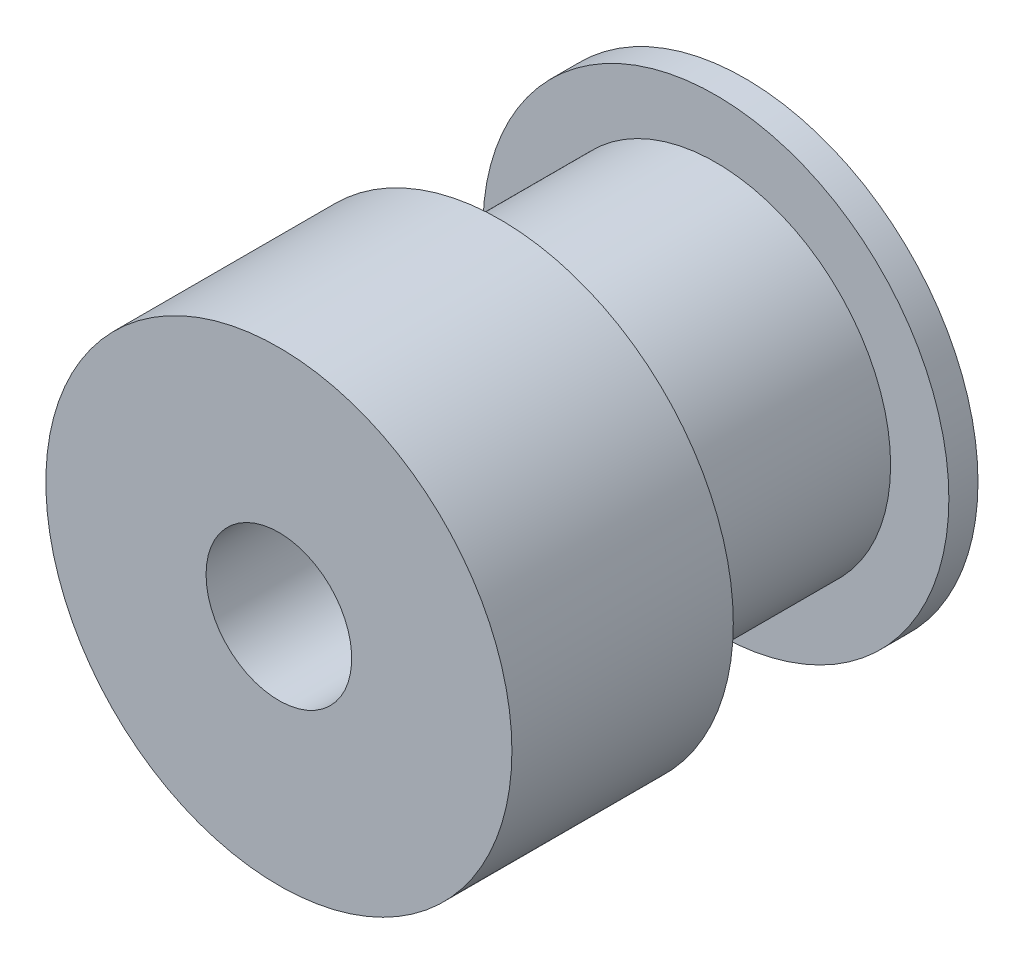
ISO-10303-21;
HEADER;
FILE_DESCRIPTION(('STEP AP214'),'2;1');
FILE_NAME('part.step','',(''),(''),'','','');
FILE_SCHEMA(('AUTOMOTIVE_DESIGN { 1 0 10303 214 1 1 1 1 }'));
ENDSEC;
DATA;
#1=APPLICATION_CONTEXT('core data for automotive mechanical design processes');
#2=APPLICATION_PROTOCOL_DEFINITION('international standard','automotive_design',2000,#1);
#3=PRODUCT_CONTEXT('',#1,'mechanical');
#4=PRODUCT('Part','Part','',(#3));
#5=PRODUCT_RELATED_PRODUCT_CATEGORY('part','',(#4));
#6=PRODUCT_DEFINITION_FORMATION('','',#4);
#7=PRODUCT_DEFINITION_CONTEXT('part definition',#1,'design');
#8=PRODUCT_DEFINITION('design','',#6,#7);
#9=PRODUCT_DEFINITION_SHAPE('','',#8);
#10=(LENGTH_UNIT() NAMED_UNIT(*) SI_UNIT(.MILLI.,.METRE.));
#11=(NAMED_UNIT(*) PLANE_ANGLE_UNIT() SI_UNIT($,.RADIAN.));
#12=(NAMED_UNIT(*) SI_UNIT($,.STERADIAN.) SOLID_ANGLE_UNIT());
#13=UNCERTAINTY_MEASURE_WITH_UNIT(LENGTH_MEASURE(1.E-05),#10,'distance_accuracy_value','');
#14=(GEOMETRIC_REPRESENTATION_CONTEXT(3) GLOBAL_UNCERTAINTY_ASSIGNED_CONTEXT((#13)) GLOBAL_UNIT_ASSIGNED_CONTEXT((#10,
#11,#12)) REPRESENTATION_CONTEXT('',''));
#15=CARTESIAN_POINT('',(0.,0.,0.));
#16=DIRECTION('',(0.,0.,1.));
#17=DIRECTION('',(1.,0.,0.));
#18=AXIS2_PLACEMENT_3D('',#15,#16,#17);
#19=CARTESIAN_POINT('',(0.,0.,1.));
#20=DIRECTION('',(0.,0.,-1.));
#21=DIRECTION('',(-1.,0.,0.));
#22=AXIS2_PLACEMENT_3D('',#19,#20,#21);
#23=CYLINDRICAL_SURFACE('',#22,8.);
#24=CARTESIAN_POINT('',(0.,0.,1.));
#25=DIRECTION('',(0.,0.,1.));
#26=DIRECTION('',(1.,0.,0.));
#27=AXIS2_PLACEMENT_3D('',#24,#25,#26);
#28=CIRCLE('',#27,8.);
#29=CARTESIAN_POINT('',(8.,0.,1.));
#30=VERTEX_POINT('',#29);
#31=EDGE_CURVE('E10',#30,#30,#28,.T.);
#32=ORIENTED_EDGE('',*,*,#31,.F.);
#33=EDGE_LOOP('',(#32));
#34=FACE_BOUND('',#33,.T.);
#35=CARTESIAN_POINT('',(0.,0.,0.));
#36=DIRECTION('',(0.,0.,1.));
#37=DIRECTION('',(1.,0.,0.));
#38=AXIS2_PLACEMENT_3D('',#35,#36,#37);
#39=CIRCLE('',#38,8.);
#40=CARTESIAN_POINT('',(8.,0.,0.));
#41=VERTEX_POINT('',#40);
#42=EDGE_CURVE('E36',#41,#41,#39,.T.);
#43=ORIENTED_EDGE('',*,*,#42,.T.);
#44=EDGE_LOOP('',(#43));
#45=FACE_BOUND('',#44,.T.);
#46=ADVANCED_FACE('F33',(#34,#45),#23,.T.);
#47=CARTESIAN_POINT('',(0.,0.,1.));
#48=DIRECTION('',(0.,0.,1.));
#49=DIRECTION('',(1.,0.,0.));
#50=AXIS2_PLACEMENT_3D('',#47,#48,#49);
#51=PLANE('',#50);
#52=CARTESIAN_POINT('',(0.,0.,1.));
#53=DIRECTION('',(0.,0.,1.));
#54=DIRECTION('',(1.,0.,0.));
#55=AXIS2_PLACEMENT_3D('',#52,#53,#54);
#56=CIRCLE('',#55,6.);
#57=CARTESIAN_POINT('',(6.,0.,1.));
#58=VERTEX_POINT('',#57);
#59=EDGE_CURVE('E45',#58,#58,#56,.T.);
#60=ORIENTED_EDGE('',*,*,#59,.F.);
#61=EDGE_LOOP('',(#60));
#62=FACE_BOUND('',#61,.T.);
#63=ORIENTED_EDGE('',*,*,#31,.T.);
#64=EDGE_LOOP('',(#63));
#65=FACE_BOUND('',#64,.T.);
#66=ADVANCED_FACE('F77',(#62,#65),#51,.T.);
#67=CARTESIAN_POINT('',(0.,0.,0.));
#68=DIRECTION('',(0.,0.,1.));
#69=DIRECTION('',(1.,0.,0.));
#70=AXIS2_PLACEMENT_3D('',#67,#68,#69);
#71=PLANE('',#70);
#72=CARTESIAN_POINT('',(0.,0.,0.));
#73=DIRECTION('',(0.,0.,-1.));
#74=DIRECTION('',(-1.,0.,0.));
#75=AXIS2_PLACEMENT_3D('',#72,#73,#74);
#76=CIRCLE('',#75,2.5);
#77=CARTESIAN_POINT('',(-2.5,0.,0.));
#78=VERTEX_POINT('',#77);
#79=EDGE_CURVE('E57',#78,#78,#76,.T.);
#80=ORIENTED_EDGE('',*,*,#79,.F.);
#81=EDGE_LOOP('',(#80));
#82=FACE_BOUND('',#81,.T.);
#83=ORIENTED_EDGE('',*,*,#42,.F.);
#84=EDGE_LOOP('',(#83));
#85=FACE_BOUND('',#84,.T.);
#86=ADVANCED_FACE('F73',(#82,#85),#71,.F.);
#87=CARTESIAN_POINT('',(0.,0.,8.4));
#88=DIRECTION('',(0.,0.,-1.));
#89=DIRECTION('',(-1.,0.,0.));
#90=AXIS2_PLACEMENT_3D('',#87,#88,#89);
#91=CYLINDRICAL_SURFACE('',#90,6.);
#92=CARTESIAN_POINT('',(0.,0.,8.4));
#93=DIRECTION('',(0.,0.,1.));
#94=DIRECTION('',(1.,0.,0.));
#95=AXIS2_PLACEMENT_3D('',#92,#93,#94);
#96=CIRCLE('',#95,6.);
#97=CARTESIAN_POINT('',(6.,0.,8.4));
#98=VERTEX_POINT('',#97);
#99=EDGE_CURVE('E43',#98,#98,#96,.T.);
#100=ORIENTED_EDGE('',*,*,#99,.F.);
#101=EDGE_LOOP('',(#100));
#102=FACE_BOUND('',#101,.T.);
#103=ORIENTED_EDGE('',*,*,#59,.T.);
#104=EDGE_LOOP('',(#103));
#105=FACE_BOUND('',#104,.T.);
#106=ADVANCED_FACE('F76',(#102,#105),#91,.T.);
#107=CARTESIAN_POINT('',(0.,0.,16.));
#108=DIRECTION('',(0.,0.,-1.));
#109=DIRECTION('',(-1.,0.,0.));
#110=AXIS2_PLACEMENT_3D('',#107,#108,#109);
#111=CYLINDRICAL_SURFACE('',#110,8.);
#112=CARTESIAN_POINT('',(0.,0.,16.));
#113=DIRECTION('',(0.,0.,1.));
#114=DIRECTION('',(1.,0.,0.));
#115=AXIS2_PLACEMENT_3D('',#112,#113,#114);
#116=CIRCLE('',#115,8.);
#117=CARTESIAN_POINT('',(8.,0.,16.));
#118=VERTEX_POINT('',#117);
#119=EDGE_CURVE('E48',#118,#118,#116,.T.);
#120=ORIENTED_EDGE('',*,*,#119,.F.);
#121=EDGE_LOOP('',(#120));
#122=FACE_BOUND('',#121,.T.);
#123=CARTESIAN_POINT('',(0.,0.,8.4));
#124=DIRECTION('',(0.,0.,1.));
#125=DIRECTION('',(1.,0.,0.));
#126=AXIS2_PLACEMENT_3D('',#123,#124,#125);
#127=CIRCLE('',#126,8.);
#128=CARTESIAN_POINT('',(8.,0.,8.4));
#129=VERTEX_POINT('',#128);
#130=EDGE_CURVE('E51',#129,#129,#127,.T.);
#131=ORIENTED_EDGE('',*,*,#130,.T.);
#132=EDGE_LOOP('',(#131));
#133=FACE_BOUND('',#132,.T.);
#134=ADVANCED_FACE('F93',(#122,#133),#111,.T.);
#135=CARTESIAN_POINT('',(0.,0.,16.));
#136=DIRECTION('',(0.,0.,1.));
#137=DIRECTION('',(1.,0.,0.));
#138=AXIS2_PLACEMENT_3D('',#135,#136,#137);
#139=PLANE('',#138);
#140=CARTESIAN_POINT('',(0.,0.,16.));
#141=DIRECTION('',(0.,0.,-1.));
#142=DIRECTION('',(-1.,0.,0.));
#143=AXIS2_PLACEMENT_3D('',#140,#141,#142);
#144=CIRCLE('',#143,2.5);
#145=CARTESIAN_POINT('',(-2.5,0.,16.));
#146=VERTEX_POINT('',#145);
#147=EDGE_CURVE('E54',#146,#146,#144,.T.);
#148=ORIENTED_EDGE('',*,*,#147,.T.);
#149=EDGE_LOOP('',(#148));
#150=FACE_BOUND('',#149,.T.);
#151=ORIENTED_EDGE('',*,*,#119,.T.);
#152=EDGE_LOOP('',(#151));
#153=FACE_BOUND('',#152,.T.);
#154=ADVANCED_FACE('F63',(#150,#153),#139,.T.);
#155=CARTESIAN_POINT('',(0.,0.,8.4));
#156=DIRECTION('',(0.,0.,1.));
#157=DIRECTION('',(1.,0.,0.));
#158=AXIS2_PLACEMENT_3D('',#155,#156,#157);
#159=PLANE('',#158);
#160=ORIENTED_EDGE('',*,*,#99,.T.);
#161=EDGE_LOOP('',(#160));
#162=FACE_BOUND('',#161,.T.);
#163=ORIENTED_EDGE('',*,*,#130,.F.);
#164=EDGE_LOOP('',(#163));
#165=FACE_BOUND('',#164,.T.);
#166=ADVANCED_FACE('F69',(#162,#165),#159,.F.);
#167=CARTESIAN_POINT('',(0.,0.,16.));
#168=DIRECTION('',(0.,0.,-1.));
#169=DIRECTION('',(-1.,0.,0.));
#170=AXIS2_PLACEMENT_3D('',#167,#168,#169);
#171=CYLINDRICAL_SURFACE('',#170,2.5);
#172=ORIENTED_EDGE('',*,*,#147,.F.);
#173=EDGE_LOOP('',(#172));
#174=FACE_BOUND('',#173,.T.);
#175=ORIENTED_EDGE('',*,*,#79,.T.);
#176=EDGE_LOOP('',(#175));
#177=FACE_BOUND('',#176,.T.);
#178=ADVANCED_FACE('F66',(#174,#177),#171,.F.);
#179=CLOSED_SHELL('',(#46,#66,#86,#106,#134,#154,#166,#178));
#180=MANIFOLD_SOLID_BREP('B2',#179);
#181=ADVANCED_BREP_SHAPE_REPRESENTATION('',(#18,#180),#14);
#182=SHAPE_DEFINITION_REPRESENTATION(#9,#181);
ENDSEC;
END-ISO-10303-21;
